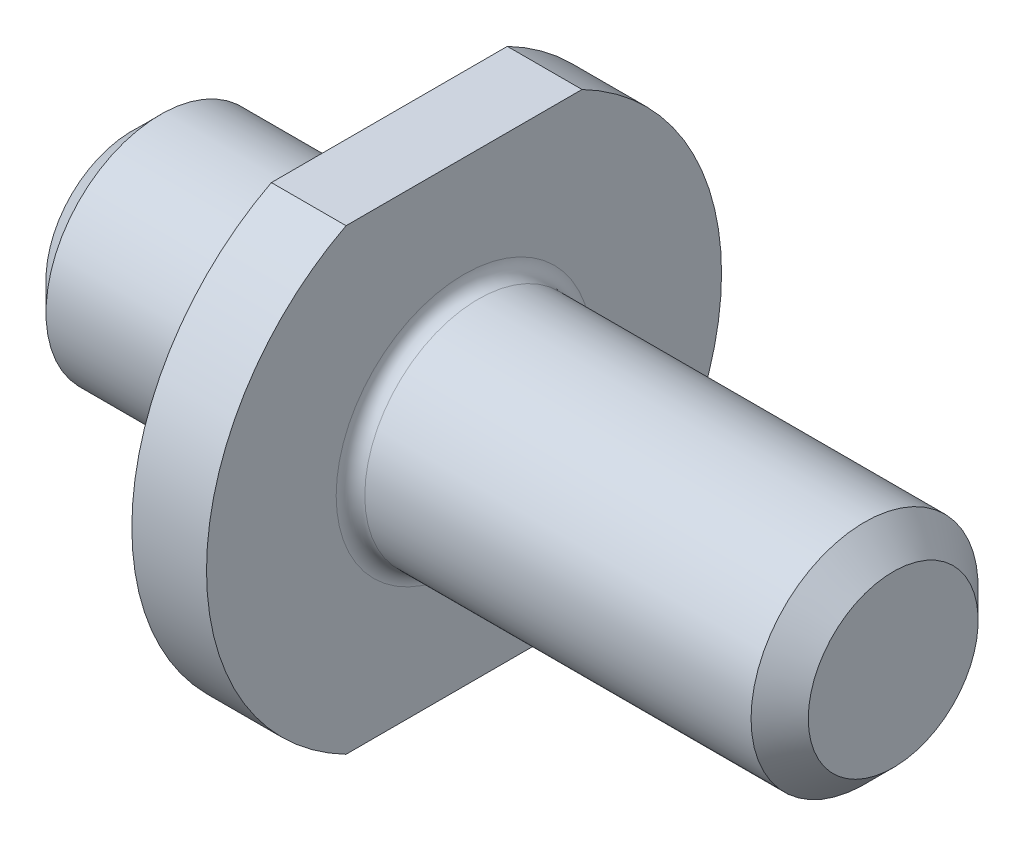
ISO-10303-21;
HEADER;
FILE_DESCRIPTION(('STEP AP214'),'2;1');
FILE_NAME('part.step','',(''),(''),'','','');
FILE_SCHEMA(('AUTOMOTIVE_DESIGN { 1 0 10303 214 1 1 1 1 }'));
ENDSEC;
DATA;
#1=APPLICATION_CONTEXT('core data for automotive mechanical design processes');
#2=APPLICATION_PROTOCOL_DEFINITION('international standard','automotive_design',2000,#1);
#3=PRODUCT_CONTEXT('',#1,'mechanical');
#4=PRODUCT('Part','Part','',(#3));
#5=PRODUCT_RELATED_PRODUCT_CATEGORY('part','',(#4));
#6=PRODUCT_DEFINITION_FORMATION('','',#4);
#7=PRODUCT_DEFINITION_CONTEXT('part definition',#1,'design');
#8=PRODUCT_DEFINITION('design','',#6,#7);
#9=PRODUCT_DEFINITION_SHAPE('','',#8);
#10=(LENGTH_UNIT() NAMED_UNIT(*) SI_UNIT(.MILLI.,.METRE.));
#11=(NAMED_UNIT(*) PLANE_ANGLE_UNIT() SI_UNIT($,.RADIAN.));
#12=(NAMED_UNIT(*) SI_UNIT($,.STERADIAN.) SOLID_ANGLE_UNIT());
#13=UNCERTAINTY_MEASURE_WITH_UNIT(LENGTH_MEASURE(1.E-05),#10,'distance_accuracy_value','');
#14=(GEOMETRIC_REPRESENTATION_CONTEXT(3) GLOBAL_UNCERTAINTY_ASSIGNED_CONTEXT((#13)) GLOBAL_UNIT_ASSIGNED_CONTEXT((#10,
#11,#12)) REPRESENTATION_CONTEXT('',''));
#15=CARTESIAN_POINT('',(0.,0.,0.));
#16=DIRECTION('',(0.,0.,1.));
#17=DIRECTION('',(1.,0.,0.));
#18=AXIS2_PLACEMENT_3D('',#15,#16,#17);
#19=CARTESIAN_POINT('',(-38.1740269755591,0.,0.));
#20=DIRECTION('',(-1.,0.,0.));
#21=DIRECTION('',(0.,0.,1.));
#22=AXIS2_PLACEMENT_3D('',#19,#20,#21);
#23=CYLINDRICAL_SURFACE('',#22,9.);
#24=CARTESIAN_POINT('',(2.61,0.,0.));
#25=DIRECTION('',(-1.,0.,0.));
#26=DIRECTION('',(0.,0.,1.));
#27=AXIS2_PLACEMENT_3D('',#24,#25,#26);
#28=CIRCLE('',#27,9.);
#29=CARTESIAN_POINT('',(2.61,-8.,4.12310562561766));
#30=VERTEX_POINT('',#29);
#31=CARTESIAN_POINT('',(2.61,8.,4.12310562561766));
#32=VERTEX_POINT('',#31);
#33=EDGE_CURVE('E101',#30,#32,#28,.T.);
#34=ORIENTED_EDGE('',*,*,#33,.T.);
#35=DIRECTION('',(-1.,0.,0.));
#36=VECTOR('',#35,1.);
#37=CARTESIAN_POINT('',(-38.1740269755591,8.,4.12310562561766));
#38=LINE('',#37,#36);
#39=CARTESIAN_POINT('',(0.,8.,4.12310562561766));
#40=VERTEX_POINT('',#39);
#41=EDGE_CURVE('E187',#32,#40,#38,.T.);
#42=ORIENTED_EDGE('',*,*,#41,.T.);
#43=CARTESIAN_POINT('',(0.,0.,0.));
#44=DIRECTION('',(-1.,0.,0.));
#45=DIRECTION('',(0.,0.,1.));
#46=AXIS2_PLACEMENT_3D('',#43,#44,#45);
#47=CIRCLE('',#46,9.);
#48=CARTESIAN_POINT('',(0.,-8.,4.12310562561766));
#49=VERTEX_POINT('',#48);
#50=EDGE_CURVE('E102',#49,#40,#47,.T.);
#51=ORIENTED_EDGE('',*,*,#50,.F.);
#52=DIRECTION('',(-1.,0.,0.));
#53=VECTOR('',#52,1.);
#54=CARTESIAN_POINT('',(-38.1740269755591,-8.,4.12310562561766));
#55=LINE('',#54,#53);
#56=EDGE_CURVE('E60',#49,#30,#55,.F.);
#57=ORIENTED_EDGE('',*,*,#56,.T.);
#58=EDGE_LOOP('',(#34,#42,#51,#57));
#59=FACE_BOUND('',#58,.T.);
#60=ADVANCED_FACE('F45',(#59),#23,.T.);
#61=CARTESIAN_POINT('',(-38.1740269755591,0.,0.));
#62=DIRECTION('',(-1.,0.,0.));
#63=DIRECTION('',(0.,0.,1.));
#64=AXIS2_PLACEMENT_3D('',#61,#62,#63);
#65=CYLINDRICAL_SURFACE('',#64,4.);
#66=CARTESIAN_POINT('',(-0.5,0.,0.));
#67=DIRECTION('',(1.,0.,0.));
#68=DIRECTION('',(0.,0.,-1.));
#69=AXIS2_PLACEMENT_3D('',#66,#67,#68);
#70=CIRCLE('',#69,4.);
#71=CARTESIAN_POINT('',(-0.5,0.,-4.));
#72=VERTEX_POINT('',#71);
#73=EDGE_CURVE('E128',#72,#72,#70,.F.);
#74=ORIENTED_EDGE('',*,*,#73,.T.);
#75=EDGE_LOOP('',(#74));
#76=FACE_BOUND('',#75,.T.);
#77=CARTESIAN_POINT('',(-7.99999999999999,0.,0.));
#78=DIRECTION('',(1.,0.,0.));
#79=DIRECTION('',(0.,0.,-1.));
#80=AXIS2_PLACEMENT_3D('',#77,#78,#79);
#81=CIRCLE('',#80,4.);
#82=CARTESIAN_POINT('',(-7.99999999999999,0.,-4.));
#83=VERTEX_POINT('',#82);
#84=EDGE_CURVE('E113',#83,#83,#81,.T.);
#85=ORIENTED_EDGE('',*,*,#84,.T.);
#86=EDGE_LOOP('',(#85));
#87=FACE_BOUND('',#86,.T.);
#88=ADVANCED_FACE('F140',(#76,#87),#65,.T.);
#89=CARTESIAN_POINT('',(-9.,0.,0.));
#90=DIRECTION('',(1.,0.,0.));
#91=DIRECTION('',(0.,0.,-1.));
#92=AXIS2_PLACEMENT_3D('',#89,#90,#91);
#93=PLANE('',#92);
#94=CARTESIAN_POINT('',(-9.,0.,0.));
#95=DIRECTION('',(1.,0.,0.));
#96=DIRECTION('',(0.,0.,-1.));
#97=AXIS2_PLACEMENT_3D('',#94,#95,#96);
#98=CIRCLE('',#97,2.99999999999999);
#99=CARTESIAN_POINT('',(-9.,0.,-2.99999999999999));
#100=VERTEX_POINT('',#99);
#101=EDGE_CURVE('E110',#100,#100,#98,.F.);
#102=ORIENTED_EDGE('',*,*,#101,.T.);
#103=EDGE_LOOP('',(#102));
#104=FACE_BOUND('',#103,.T.);
#105=ADVANCED_FACE('F143',(#104),#93,.F.);
#106=CARTESIAN_POINT('',(17.61,3.96875,0.));
#107=DIRECTION('',(-1.,0.,0.));
#108=DIRECTION('',(0.,0.,1.));
#109=AXIS2_PLACEMENT_3D('',#106,#107,#108);
#110=PLANE('',#109);
#111=CARTESIAN_POINT('',(17.61,0.,0.));
#112=DIRECTION('',(-1.,0.,0.));
#113=DIRECTION('',(0.,0.,1.));
#114=AXIS2_PLACEMENT_3D('',#111,#112,#113);
#115=CIRCLE('',#114,2.96874999999999);
#116=CARTESIAN_POINT('',(17.61,0.,2.96874999999999));
#117=VERTEX_POINT('',#116);
#118=EDGE_CURVE('E119',#117,#117,#115,.F.);
#119=ORIENTED_EDGE('',*,*,#118,.T.);
#120=EDGE_LOOP('',(#119));
#121=FACE_BOUND('',#120,.T.);
#122=ADVANCED_FACE('F155',(#121),#110,.F.);
#123=CARTESIAN_POINT('',(-38.1740269755591,0.,0.));
#124=DIRECTION('',(-1.,0.,0.));
#125=DIRECTION('',(0.,0.,1.));
#126=AXIS2_PLACEMENT_3D('',#123,#124,#125);
#127=CYLINDRICAL_SURFACE('',#126,3.96875);
#128=CARTESIAN_POINT('',(3.11,0.,0.));
#129=DIRECTION('',(-1.,0.,0.));
#130=DIRECTION('',(0.,0.,1.));
#131=AXIS2_PLACEMENT_3D('',#128,#129,#130);
#132=CIRCLE('',#131,3.96875);
#133=CARTESIAN_POINT('',(3.11,0.,3.96875));
#134=VERTEX_POINT('',#133);
#135=EDGE_CURVE('E125',#134,#134,#132,.F.);
#136=ORIENTED_EDGE('',*,*,#135,.T.);
#137=EDGE_LOOP('',(#136));
#138=FACE_BOUND('',#137,.T.);
#139=CARTESIAN_POINT('',(16.61,0.,0.));
#140=DIRECTION('',(-1.,0.,0.));
#141=DIRECTION('',(0.,0.,1.));
#142=AXIS2_PLACEMENT_3D('',#139,#140,#141);
#143=CIRCLE('',#142,3.96875);
#144=CARTESIAN_POINT('',(16.61,0.,3.96875));
#145=VERTEX_POINT('',#144);
#146=EDGE_CURVE('E116',#145,#145,#143,.T.);
#147=ORIENTED_EDGE('',*,*,#146,.T.);
#148=EDGE_LOOP('',(#147));
#149=FACE_BOUND('',#148,.T.);
#150=ADVANCED_FACE('F160',(#138,#149),#127,.T.);
#151=CARTESIAN_POINT('',(2.61,9.,0.));
#152=DIRECTION('',(-1.,0.,0.));
#153=DIRECTION('',(0.,0.,1.));
#154=AXIS2_PLACEMENT_3D('',#151,#152,#153);
#155=PLANE('',#154);
#156=CARTESIAN_POINT('',(2.61,0.,0.));
#157=DIRECTION('',(-1.,0.,0.));
#158=DIRECTION('',(0.,0.,1.));
#159=AXIS2_PLACEMENT_3D('',#156,#157,#158);
#160=CIRCLE('',#159,4.46875);
#161=CARTESIAN_POINT('',(2.61,0.,4.46875));
#162=VERTEX_POINT('',#161);
#163=EDGE_CURVE('E122',#162,#162,#160,.T.);
#164=ORIENTED_EDGE('',*,*,#163,.T.);
#165=EDGE_LOOP('',(#164));
#166=FACE_BOUND('',#165,.T.);
#167=CARTESIAN_POINT('',(2.61,8.,-4.12310562561766));
#168=VERTEX_POINT('',#167);
#169=CARTESIAN_POINT('',(2.61,-8.,-4.12310562561766));
#170=VERTEX_POINT('',#169);
#171=EDGE_CURVE('E97',#168,#170,#28,.T.);
#172=ORIENTED_EDGE('',*,*,#171,.F.);
#173=DIRECTION('',(0.,0.,1.));
#174=VECTOR('',#173,1.);
#175=CARTESIAN_POINT('',(2.61,8.,0.));
#176=LINE('',#175,#174);
#177=EDGE_CURVE('E106',#168,#32,#176,.T.);
#178=ORIENTED_EDGE('',*,*,#177,.T.);
#179=ORIENTED_EDGE('',*,*,#33,.F.);
#180=DIRECTION('',(0.,0.,-1.));
#181=VECTOR('',#180,1.);
#182=CARTESIAN_POINT('',(2.61,-8.,0.));
#183=LINE('',#182,#181);
#184=EDGE_CURVE('E98',#30,#170,#183,.T.);
#185=ORIENTED_EDGE('',*,*,#184,.T.);
#186=EDGE_LOOP('',(#172,#178,#179,#185));
#187=FACE_BOUND('',#186,.T.);
#188=ADVANCED_FACE('F171',(#166,#187),#155,.F.);
#189=CARTESIAN_POINT('',(0.,8.,-4.12310562561766));
#190=VERTEX_POINT('',#189);
#191=CARTESIAN_POINT('',(0.,-8.,-4.12310562561766));
#192=VERTEX_POINT('',#191);
#193=EDGE_CURVE('E95',#190,#192,#47,.T.);
#194=ORIENTED_EDGE('',*,*,#193,.F.);
#195=DIRECTION('',(-1.,0.,0.));
#196=VECTOR('',#195,1.);
#197=CARTESIAN_POINT('',(-38.1740269755591,8.,-4.12310562561766));
#198=LINE('',#197,#196);
#199=EDGE_CURVE('E68',#190,#168,#198,.F.);
#200=ORIENTED_EDGE('',*,*,#199,.T.);
#201=ORIENTED_EDGE('',*,*,#171,.T.);
#202=DIRECTION('',(-1.,0.,0.));
#203=VECTOR('',#202,1.);
#204=CARTESIAN_POINT('',(-38.1740269755591,-8.,-4.12310562561766));
#205=LINE('',#204,#203);
#206=EDGE_CURVE('E84',#170,#192,#205,.T.);
#207=ORIENTED_EDGE('',*,*,#206,.T.);
#208=EDGE_LOOP('',(#194,#200,#201,#207));
#209=FACE_BOUND('',#208,.T.);
#210=ADVANCED_FACE('F94',(#209),#23,.T.);
#211=CARTESIAN_POINT('',(0.,4.,0.));
#212=DIRECTION('',(1.,0.,0.));
#213=DIRECTION('',(0.,0.,-1.));
#214=AXIS2_PLACEMENT_3D('',#211,#212,#213);
#215=PLANE('',#214);
#216=CARTESIAN_POINT('',(0.,0.,0.));
#217=DIRECTION('',(1.,0.,0.));
#218=DIRECTION('',(0.,0.,-1.));
#219=AXIS2_PLACEMENT_3D('',#216,#217,#218);
#220=CIRCLE('',#219,4.5);
#221=CARTESIAN_POINT('',(0.,0.,-4.5));
#222=VERTEX_POINT('',#221);
#223=EDGE_CURVE('E90',#222,#222,#220,.T.);
#224=ORIENTED_EDGE('',*,*,#223,.T.);
#225=EDGE_LOOP('',(#224));
#226=FACE_BOUND('',#225,.T.);
#227=ORIENTED_EDGE('',*,*,#50,.T.);
#228=DIRECTION('',(0.,0.,-1.));
#229=VECTOR('',#228,1.);
#230=CARTESIAN_POINT('',(0.,8.,0.));
#231=LINE('',#230,#229);
#232=EDGE_CURVE('E12',#40,#190,#231,.T.);
#233=ORIENTED_EDGE('',*,*,#232,.T.);
#234=ORIENTED_EDGE('',*,*,#193,.T.);
#235=DIRECTION('',(0.,0.,1.));
#236=VECTOR('',#235,1.);
#237=CARTESIAN_POINT('',(0.,-8.,0.));
#238=LINE('',#237,#236);
#239=EDGE_CURVE('E53',#192,#49,#238,.T.);
#240=ORIENTED_EDGE('',*,*,#239,.T.);
#241=EDGE_LOOP('',(#227,#233,#234,#240));
#242=FACE_BOUND('',#241,.T.);
#243=ADVANCED_FACE('F100',(#226,#242),#215,.F.);
#244=CARTESIAN_POINT('',(-9.,0.,0.));
#245=DIRECTION('',(1.,0.,0.));
#246=DIRECTION('',(0.,0.,-1.));
#247=AXIS2_PLACEMENT_3D('',#244,#245,#246);
#248=CONICAL_SURFACE('',#247,2.99999999999999,0.785398163397448);
#249=ORIENTED_EDGE('',*,*,#84,.F.);
#250=EDGE_LOOP('',(#249));
#251=FACE_BOUND('',#250,.T.);
#252=ORIENTED_EDGE('',*,*,#101,.F.);
#253=EDGE_LOOP('',(#252));
#254=FACE_BOUND('',#253,.T.);
#255=ADVANCED_FACE('F147',(#251,#254),#248,.T.);
#256=CARTESIAN_POINT('',(16.61,0.,0.));
#257=DIRECTION('',(-1.,0.,0.));
#258=DIRECTION('',(0.,0.,1.));
#259=AXIS2_PLACEMENT_3D('',#256,#257,#258);
#260=CONICAL_SURFACE('',#259,3.96875,0.78539816339745);
#261=ORIENTED_EDGE('',*,*,#118,.F.);
#262=EDGE_LOOP('',(#261));
#263=FACE_BOUND('',#262,.T.);
#264=ORIENTED_EDGE('',*,*,#146,.F.);
#265=EDGE_LOOP('',(#264));
#266=FACE_BOUND('',#265,.T.);
#267=ADVANCED_FACE('F150',(#263,#266),#260,.T.);
#268=CARTESIAN_POINT('',(3.11,0.,0.));
#269=DIRECTION('',(-1.,0.,0.));
#270=DIRECTION('',(0.,0.,1.));
#271=AXIS2_PLACEMENT_3D('',#268,#269,#270);
#272=TOROIDAL_SURFACE('',#271,4.46875,0.5);
#273=ORIENTED_EDGE('',*,*,#135,.F.);
#274=EDGE_LOOP('',(#273));
#275=FACE_BOUND('',#274,.T.);
#276=ORIENTED_EDGE('',*,*,#163,.F.);
#277=EDGE_LOOP('',(#276));
#278=FACE_BOUND('',#277,.T.);
#279=ADVANCED_FACE('F137',(#275,#278),#272,.F.);
#280=CARTESIAN_POINT('',(-0.5,0.,0.));
#281=DIRECTION('',(1.,0.,0.));
#282=DIRECTION('',(0.,0.,-1.));
#283=AXIS2_PLACEMENT_3D('',#280,#281,#282);
#284=TOROIDAL_SURFACE('',#283,4.5,0.5);
#285=ORIENTED_EDGE('',*,*,#223,.F.);
#286=EDGE_LOOP('',(#285));
#287=FACE_BOUND('',#286,.T.);
#288=ORIENTED_EDGE('',*,*,#73,.F.);
#289=EDGE_LOOP('',(#288));
#290=FACE_BOUND('',#289,.T.);
#291=ADVANCED_FACE('F47',(#287,#290),#284,.F.);
#292=CARTESIAN_POINT('',(17.61,-8.,13.3780020934982));
#293=DIRECTION('',(0.,1.,0.));
#294=DIRECTION('',(0.,0.,1.));
#295=AXIS2_PLACEMENT_3D('',#292,#293,#294);
#296=PLANE('',#295);
#297=ORIENTED_EDGE('',*,*,#56,.F.);
#298=ORIENTED_EDGE('',*,*,#239,.F.);
#299=ORIENTED_EDGE('',*,*,#206,.F.);
#300=ORIENTED_EDGE('',*,*,#184,.F.);
#301=EDGE_LOOP('',(#297,#298,#299,#300));
#302=FACE_BOUND('',#301,.T.);
#303=ADVANCED_FACE('F83',(#302),#296,.F.);
#304=CARTESIAN_POINT('',(17.61,8.,13.3780020934982));
#305=DIRECTION('',(0.,-1.,0.));
#306=DIRECTION('',(0.,0.,-1.));
#307=AXIS2_PLACEMENT_3D('',#304,#305,#306);
#308=PLANE('',#307);
#309=ORIENTED_EDGE('',*,*,#199,.F.);
#310=ORIENTED_EDGE('',*,*,#232,.F.);
#311=ORIENTED_EDGE('',*,*,#41,.F.);
#312=ORIENTED_EDGE('',*,*,#177,.F.);
#313=EDGE_LOOP('',(#309,#310,#311,#312));
#314=FACE_BOUND('',#313,.T.);
#315=ADVANCED_FACE('F191',(#314),#308,.F.);
#316=CLOSED_SHELL('',(#60,#88,#105,#122,#150,#188,#210,#243,#255,#267,#279,#291,#303,#315));
#317=MANIFOLD_SOLID_BREP('B2',#316);
#318=ADVANCED_BREP_SHAPE_REPRESENTATION('',(#18,#317),#14);
#319=SHAPE_DEFINITION_REPRESENTATION(#9,#318);
ENDSEC;
END-ISO-10303-21;
